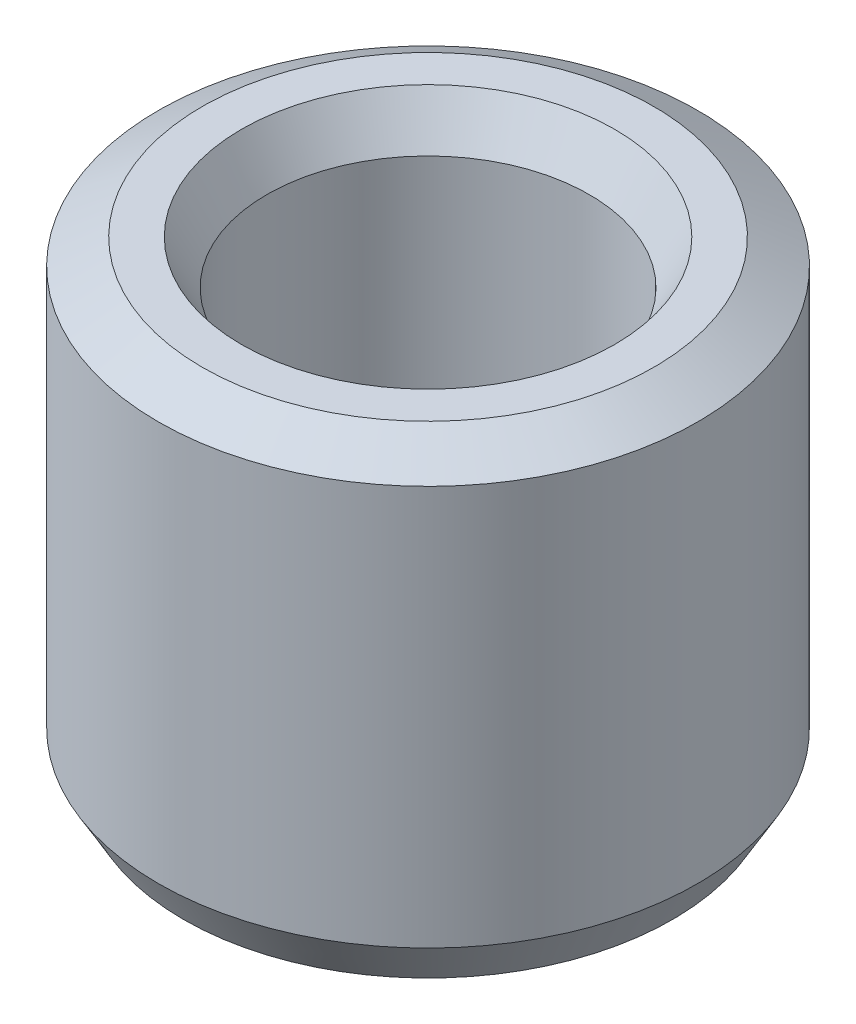
ISO-10303-21;
HEADER;
FILE_DESCRIPTION(('STEP AP214'),'2;1');
FILE_NAME('part.step','',(''),(''),'','','');
FILE_SCHEMA(('AUTOMOTIVE_DESIGN { 1 0 10303 214 1 1 1 1 }'));
ENDSEC;
DATA;
#1=APPLICATION_CONTEXT('core data for automotive mechanical design processes');
#2=APPLICATION_PROTOCOL_DEFINITION('international standard','automotive_design',2000,#1);
#3=PRODUCT_CONTEXT('',#1,'mechanical');
#4=PRODUCT('Part','Part','',(#3));
#5=PRODUCT_RELATED_PRODUCT_CATEGORY('part','',(#4));
#6=PRODUCT_DEFINITION_FORMATION('','',#4);
#7=PRODUCT_DEFINITION_CONTEXT('part definition',#1,'design');
#8=PRODUCT_DEFINITION('design','',#6,#7);
#9=PRODUCT_DEFINITION_SHAPE('','',#8);
#10=(LENGTH_UNIT() NAMED_UNIT(*) SI_UNIT(.MILLI.,.METRE.));
#11=(NAMED_UNIT(*) PLANE_ANGLE_UNIT() SI_UNIT($,.RADIAN.));
#12=(NAMED_UNIT(*) SI_UNIT($,.STERADIAN.) SOLID_ANGLE_UNIT());
#13=UNCERTAINTY_MEASURE_WITH_UNIT(LENGTH_MEASURE(1.E-05),#10,'distance_accuracy_value','');
#14=(GEOMETRIC_REPRESENTATION_CONTEXT(3) GLOBAL_UNCERTAINTY_ASSIGNED_CONTEXT((#13)) GLOBAL_UNIT_ASSIGNED_CONTEXT((#10,
#11,#12)) REPRESENTATION_CONTEXT('',''));
#15=CARTESIAN_POINT('',(0.,0.,0.));
#16=DIRECTION('',(0.,0.,1.));
#17=DIRECTION('',(1.,0.,0.));
#18=AXIS2_PLACEMENT_3D('',#15,#16,#17);
#19=CARTESIAN_POINT('',(0.,52.1715379311801,0.));
#20=DIRECTION('',(0.,-1.,0.));
#21=DIRECTION('',(0.,0.,-1.));
#22=AXIS2_PLACEMENT_3D('',#19,#20,#21);
#23=CYLINDRICAL_SURFACE('',#22,30.);
#24=CARTESIAN_POINT('',(0.,4.880503305778,0.));
#25=DIRECTION('',(0.,1.,0.));
#26=DIRECTION('',(0.,0.,1.));
#27=AXIS2_PLACEMENT_3D('',#24,#25,#26);
#28=CIRCLE('',#27,30.);
#29=CARTESIAN_POINT('',(0.,4.880503305778,30.));
#30=VERTEX_POINT('',#29);
#31=EDGE_CURVE('E10',#30,#30,#28,.T.);
#32=ORIENTED_EDGE('',*,*,#31,.T.);
#33=EDGE_LOOP('',(#32));
#34=FACE_BOUND('',#33,.T.);
#35=CARTESIAN_POINT('',(0.,49.3537780338082,0.));
#36=DIRECTION('',(0.,1.,0.));
#37=DIRECTION('',(0.,0.,1.));
#38=AXIS2_PLACEMENT_3D('',#35,#36,#37);
#39=CIRCLE('',#38,30.);
#40=CARTESIAN_POINT('',(0.,49.3537780338082,30.));
#41=VERTEX_POINT('',#40);
#42=EDGE_CURVE('E50',#41,#41,#39,.F.);
#43=ORIENTED_EDGE('',*,*,#42,.T.);
#44=EDGE_LOOP('',(#43));
#45=FACE_BOUND('',#44,.T.);
#46=ADVANCED_FACE('F39',(#34,#45),#23,.T.);
#47=CARTESIAN_POINT('',(0.,52.1715379311801,0.));
#48=DIRECTION('',(0.,1.,0.));
#49=DIRECTION('',(0.,0.,1.));
#50=AXIS2_PLACEMENT_3D('',#47,#48,#49);
#51=PLANE('',#50);
#52=CARTESIAN_POINT('',(0.,52.1715379311801,0.));
#53=DIRECTION('',(0.,1.,0.));
#54=DIRECTION('',(0.,0.,1.));
#55=AXIS2_PLACEMENT_3D('',#52,#53,#54);
#56=CIRCLE('',#55,20.7459229222923);
#57=CARTESIAN_POINT('',(0.,52.1715379311801,20.7459229222923));
#58=VERTEX_POINT('',#57);
#59=EDGE_CURVE('E58',#58,#58,#56,.F.);
#60=ORIENTED_EDGE('',*,*,#59,.T.);
#61=EDGE_LOOP('',(#60));
#62=FACE_BOUND('',#61,.T.);
#63=CARTESIAN_POINT('',(0.,52.1715379311801,0.));
#64=DIRECTION('',(0.,1.,0.));
#65=DIRECTION('',(0.,0.,1.));
#66=AXIS2_PLACEMENT_3D('',#63,#64,#65);
#67=CIRCLE('',#66,25.119496694222);
#68=CARTESIAN_POINT('',(0.,52.1715379311801,25.119496694222));
#69=VERTEX_POINT('',#68);
#70=EDGE_CURVE('E61',#69,#69,#67,.T.);
#71=ORIENTED_EDGE('',*,*,#70,.T.);
#72=EDGE_LOOP('',(#71));
#73=FACE_BOUND('',#72,.T.);
#74=ADVANCED_FACE('F88',(#62,#73),#51,.T.);
#75=CARTESIAN_POINT('',(0.,0.,0.));
#76=DIRECTION('',(0.,1.,0.));
#77=DIRECTION('',(0.,0.,1.));
#78=AXIS2_PLACEMENT_3D('',#75,#76,#77);
#79=PLANE('',#78);
#80=CARTESIAN_POINT('',(0.,0.,0.));
#81=DIRECTION('',(0.,1.,0.));
#82=DIRECTION('',(0.,0.,1.));
#83=AXIS2_PLACEMENT_3D('',#80,#81,#82);
#84=CIRCLE('',#83,22.8086663306985);
#85=CARTESIAN_POINT('',(0.,0.,22.8086663306985));
#86=VERTEX_POINT('',#85);
#87=EDGE_CURVE('E51',#86,#86,#84,.T.);
#88=ORIENTED_EDGE('',*,*,#87,.T.);
#89=EDGE_LOOP('',(#88));
#90=FACE_BOUND('',#89,.T.);
#91=CARTESIAN_POINT('',(0.,0.,0.));
#92=DIRECTION('',(0.,1.,0.));
#93=DIRECTION('',(0.,0.,1.));
#94=AXIS2_PLACEMENT_3D('',#91,#92,#93);
#95=CIRCLE('',#94,27.1822401026282);
#96=CARTESIAN_POINT('',(0.,0.,27.1822401026282));
#97=VERTEX_POINT('',#96);
#98=EDGE_CURVE('E54',#97,#97,#95,.F.);
#99=ORIENTED_EDGE('',*,*,#98,.T.);
#100=EDGE_LOOP('',(#99));
#101=FACE_BOUND('',#100,.T.);
#102=ADVANCED_FACE('F83',(#90,#101),#79,.F.);
#103=CARTESIAN_POINT('',(0.,52.1715379311801,0.));
#104=DIRECTION('',(0.,-1.,0.));
#105=DIRECTION('',(0.,0.,-1.));
#106=AXIS2_PLACEMENT_3D('',#103,#104,#105);
#107=CYLINDRICAL_SURFACE('',#106,17.9281630249205);
#108=CARTESIAN_POINT('',(0.,47.2910346254021,0.));
#109=DIRECTION('',(0.,1.,0.));
#110=DIRECTION('',(0.,0.,1.));
#111=AXIS2_PLACEMENT_3D('',#108,#109,#110);
#112=CIRCLE('',#111,17.9281630249205);
#113=CARTESIAN_POINT('',(0.,47.2910346254021,17.9281630249205));
#114=VERTEX_POINT('',#113);
#115=EDGE_CURVE('E67',#114,#114,#112,.T.);
#116=ORIENTED_EDGE('',*,*,#115,.T.);
#117=EDGE_LOOP('',(#116));
#118=FACE_BOUND('',#117,.T.);
#119=CARTESIAN_POINT('',(0.,2.8177598973718,0.));
#120=DIRECTION('',(0.,1.,0.));
#121=DIRECTION('',(0.,0.,1.));
#122=AXIS2_PLACEMENT_3D('',#119,#120,#121);
#123=CIRCLE('',#122,17.9281630249205);
#124=CARTESIAN_POINT('',(0.,2.8177598973718,17.9281630249205));
#125=VERTEX_POINT('',#124);
#126=EDGE_CURVE('E69',#125,#125,#123,.F.);
#127=ORIENTED_EDGE('',*,*,#126,.T.);
#128=EDGE_LOOP('',(#127));
#129=FACE_BOUND('',#128,.T.);
#130=ADVANCED_FACE('F71',(#118,#129),#107,.F.);
#131=CARTESIAN_POINT('',(0.,47.2910346254021,0.));
#132=DIRECTION('',(0.,1.,0.));
#133=DIRECTION('',(0.,0.,1.));
#134=AXIS2_PLACEMENT_3D('',#131,#132,#133);
#135=CONICAL_SURFACE('',#134,17.9281630249205,0.523598775598302);
#136=ORIENTED_EDGE('',*,*,#59,.F.);
#137=EDGE_LOOP('',(#136));
#138=FACE_BOUND('',#137,.T.);
#139=ORIENTED_EDGE('',*,*,#115,.F.);
#140=EDGE_LOOP('',(#139));
#141=FACE_BOUND('',#140,.T.);
#142=ADVANCED_FACE('F77',(#138,#141),#135,.F.);
#143=CARTESIAN_POINT('',(0.,0.,0.));
#144=DIRECTION('',(0.,-1.,0.));
#145=DIRECTION('',(0.,0.,-1.));
#146=AXIS2_PLACEMENT_3D('',#143,#144,#145);
#147=CONICAL_SURFACE('',#146,22.8086663306985,1.04719755119659);
#148=ORIENTED_EDGE('',*,*,#126,.F.);
#149=EDGE_LOOP('',(#148));
#150=FACE_BOUND('',#149,.T.);
#151=ORIENTED_EDGE('',*,*,#87,.F.);
#152=EDGE_LOOP('',(#151));
#153=FACE_BOUND('',#152,.T.);
#154=ADVANCED_FACE('F73',(#150,#153),#147,.F.);
#155=CARTESIAN_POINT('',(0.,4.880503305778,0.));
#156=DIRECTION('',(0.,1.,0.));
#157=DIRECTION('',(0.,0.,1.));
#158=AXIS2_PLACEMENT_3D('',#155,#156,#157);
#159=CONICAL_SURFACE('',#158,30.,0.523598775598303);
#160=ORIENTED_EDGE('',*,*,#98,.F.);
#161=EDGE_LOOP('',(#160));
#162=FACE_BOUND('',#161,.T.);
#163=ORIENTED_EDGE('',*,*,#31,.F.);
#164=EDGE_LOOP('',(#163));
#165=FACE_BOUND('',#164,.T.);
#166=ADVANCED_FACE('F76',(#162,#165),#159,.T.);
#167=CARTESIAN_POINT('',(0.,52.1715379311801,0.));
#168=DIRECTION('',(0.,-1.,0.));
#169=DIRECTION('',(0.,0.,-1.));
#170=AXIS2_PLACEMENT_3D('',#167,#168,#169);
#171=CONICAL_SURFACE('',#170,25.119496694222,1.04719755119659);
#172=ORIENTED_EDGE('',*,*,#42,.F.);
#173=EDGE_LOOP('',(#172));
#174=FACE_BOUND('',#173,.T.);
#175=ORIENTED_EDGE('',*,*,#70,.F.);
#176=EDGE_LOOP('',(#175));
#177=FACE_BOUND('',#176,.T.);
#178=ADVANCED_FACE('F45',(#174,#177),#171,.T.);
#179=CLOSED_SHELL('',(#46,#74,#102,#130,#142,#154,#166,#178));
#180=MANIFOLD_SOLID_BREP('B2',#179);
#181=ADVANCED_BREP_SHAPE_REPRESENTATION('',(#18,#180),#14);
#182=SHAPE_DEFINITION_REPRESENTATION(#9,#181);
ENDSEC;
END-ISO-10303-21;
